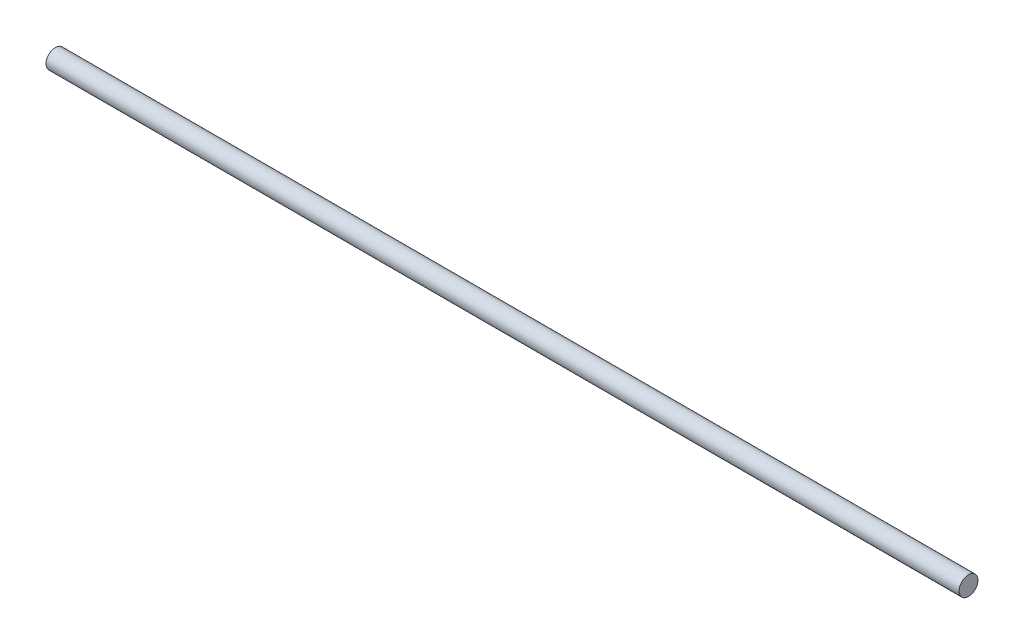
ISO-10303-21;
HEADER;
FILE_DESCRIPTION(('STEP AP214'),'2;1');
FILE_NAME('part.step','',(''),(''),'','','');
FILE_SCHEMA(('AUTOMOTIVE_DESIGN { 1 0 10303 214 1 1 1 1 }'));
ENDSEC;
DATA;
#1=APPLICATION_CONTEXT('core data for automotive mechanical design processes');
#2=APPLICATION_PROTOCOL_DEFINITION('international standard','automotive_design',2000,#1);
#3=PRODUCT_CONTEXT('',#1,'mechanical');
#4=PRODUCT('Part','Part','',(#3));
#5=PRODUCT_RELATED_PRODUCT_CATEGORY('part','',(#4));
#6=PRODUCT_DEFINITION_FORMATION('','',#4);
#7=PRODUCT_DEFINITION_CONTEXT('part definition',#1,'design');
#8=PRODUCT_DEFINITION('design','',#6,#7);
#9=PRODUCT_DEFINITION_SHAPE('','',#8);
#10=(LENGTH_UNIT() NAMED_UNIT(*) SI_UNIT(.MILLI.,.METRE.));
#11=(NAMED_UNIT(*) PLANE_ANGLE_UNIT() SI_UNIT($,.RADIAN.));
#12=(NAMED_UNIT(*) SI_UNIT($,.STERADIAN.) SOLID_ANGLE_UNIT());
#13=UNCERTAINTY_MEASURE_WITH_UNIT(LENGTH_MEASURE(1.E-05),#10,'distance_accuracy_value','');
#14=(GEOMETRIC_REPRESENTATION_CONTEXT(3) GLOBAL_UNCERTAINTY_ASSIGNED_CONTEXT((#13)) GLOBAL_UNIT_ASSIGNED_CONTEXT((#10,
#11,#12)) REPRESENTATION_CONTEXT('',''));
#15=CARTESIAN_POINT('',(0.,0.,0.));
#16=DIRECTION('',(0.,0.,1.));
#17=DIRECTION('',(1.,0.,0.));
#18=AXIS2_PLACEMENT_3D('',#15,#16,#17);
#19=CARTESIAN_POINT('',(120.65,0.,0.));
#20=DIRECTION('',(-1.,0.,0.));
#21=DIRECTION('',(0.,0.,1.));
#22=AXIS2_PLACEMENT_3D('',#19,#20,#21);
#23=CYLINDRICAL_SURFACE('',#22,2.5);
#24=CARTESIAN_POINT('',(120.65,0.,0.));
#25=DIRECTION('',(1.,0.,0.));
#26=DIRECTION('',(0.,0.,-1.));
#27=AXIS2_PLACEMENT_3D('',#24,#25,#26);
#28=CIRCLE('',#27,2.5);
#29=CARTESIAN_POINT('',(120.65,0.,-2.5));
#30=VERTEX_POINT('',#29);
#31=EDGE_CURVE('E10',#30,#30,#28,.T.);
#32=ORIENTED_EDGE('',*,*,#31,.F.);
#33=EDGE_LOOP('',(#32));
#34=FACE_BOUND('',#33,.T.);
#35=CARTESIAN_POINT('',(-120.65,0.,0.));
#36=DIRECTION('',(1.,0.,0.));
#37=DIRECTION('',(0.,0.,-1.));
#38=AXIS2_PLACEMENT_3D('',#35,#36,#37);
#39=CIRCLE('',#38,2.5);
#40=CARTESIAN_POINT('',(-120.65,0.,-2.5));
#41=VERTEX_POINT('',#40);
#42=EDGE_CURVE('E33',#41,#41,#39,.T.);
#43=ORIENTED_EDGE('',*,*,#42,.T.);
#44=EDGE_LOOP('',(#43));
#45=FACE_BOUND('',#44,.T.);
#46=ADVANCED_FACE('F30',(#34,#45),#23,.T.);
#47=CARTESIAN_POINT('',(120.65,0.,0.));
#48=DIRECTION('',(1.,0.,0.));
#49=DIRECTION('',(0.,0.,-1.));
#50=AXIS2_PLACEMENT_3D('',#47,#48,#49);
#51=PLANE('',#50);
#52=ORIENTED_EDGE('',*,*,#31,.T.);
#53=EDGE_LOOP('',(#52));
#54=FACE_BOUND('',#53,.T.);
#55=ADVANCED_FACE('F45',(#54),#51,.T.);
#56=CARTESIAN_POINT('',(-120.65,0.,0.));
#57=DIRECTION('',(1.,0.,0.));
#58=DIRECTION('',(0.,0.,-1.));
#59=AXIS2_PLACEMENT_3D('',#56,#57,#58);
#60=PLANE('',#59);
#61=ORIENTED_EDGE('',*,*,#42,.F.);
#62=EDGE_LOOP('',(#61));
#63=FACE_BOUND('',#62,.T.);
#64=ADVANCED_FACE('F43',(#63),#60,.F.);
#65=CLOSED_SHELL('',(#46,#55,#64));
#66=MANIFOLD_SOLID_BREP('B2',#65);
#67=ADVANCED_BREP_SHAPE_REPRESENTATION('',(#18,#66),#14);
#68=SHAPE_DEFINITION_REPRESENTATION(#9,#67);
ENDSEC;
END-ISO-10303-21;
